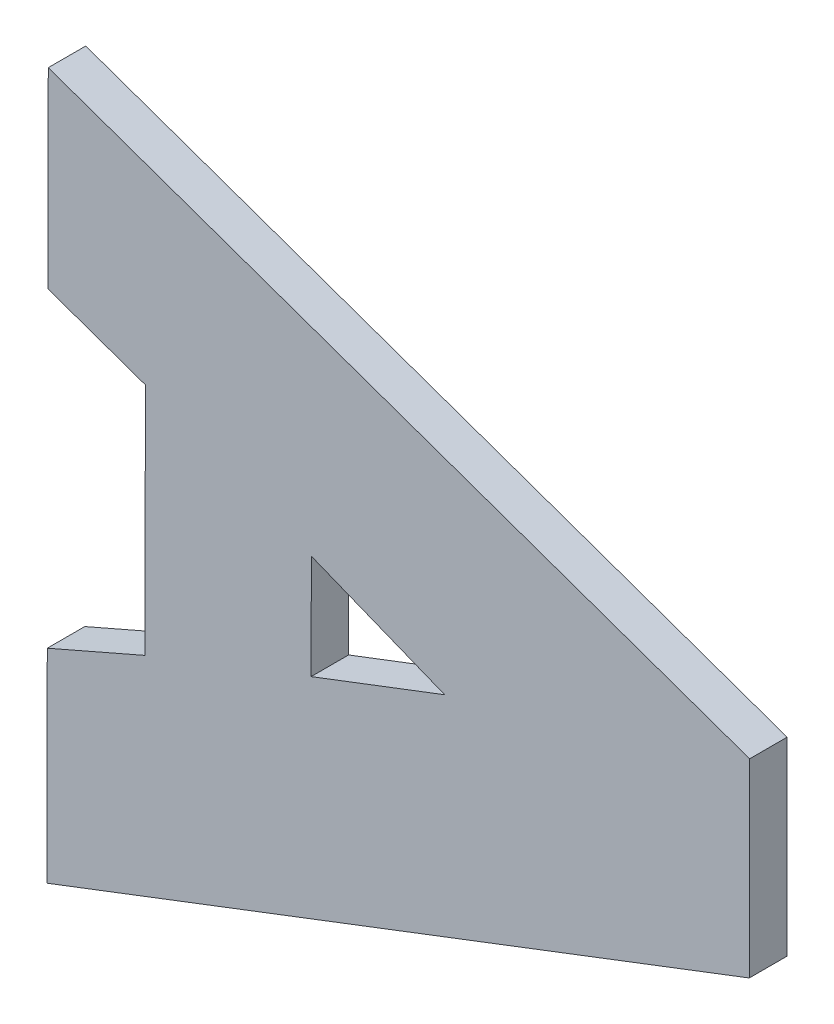
ISO-10303-21;
HEADER;
FILE_DESCRIPTION(('STEP AP214'),'2;1');
FILE_NAME('part.step','',(''),(''),'','','');
FILE_SCHEMA(('AUTOMOTIVE_DESIGN { 1 0 10303 214 1 1 1 1 }'));
ENDSEC;
DATA;
#1=APPLICATION_CONTEXT('core data for automotive mechanical design processes');
#2=APPLICATION_PROTOCOL_DEFINITION('international standard','automotive_design',2000,#1);
#3=PRODUCT_CONTEXT('',#1,'mechanical');
#4=PRODUCT('Part','Part','',(#3));
#5=PRODUCT_RELATED_PRODUCT_CATEGORY('part','',(#4));
#6=PRODUCT_DEFINITION_FORMATION('','',#4);
#7=PRODUCT_DEFINITION_CONTEXT('part definition',#1,'design');
#8=PRODUCT_DEFINITION('design','',#6,#7);
#9=PRODUCT_DEFINITION_SHAPE('','',#8);
#10=(LENGTH_UNIT() NAMED_UNIT(*) SI_UNIT(.MILLI.,.METRE.));
#11=(NAMED_UNIT(*) PLANE_ANGLE_UNIT() SI_UNIT($,.RADIAN.));
#12=(NAMED_UNIT(*) SI_UNIT($,.STERADIAN.) SOLID_ANGLE_UNIT());
#13=UNCERTAINTY_MEASURE_WITH_UNIT(LENGTH_MEASURE(1.E-05),#10,'distance_accuracy_value','');
#14=(GEOMETRIC_REPRESENTATION_CONTEXT(3) GLOBAL_UNCERTAINTY_ASSIGNED_CONTEXT((#13)) GLOBAL_UNIT_ASSIGNED_CONTEXT((#10,
#11,#12)) REPRESENTATION_CONTEXT('',''));
#15=CARTESIAN_POINT('',(0.,0.,0.));
#16=DIRECTION('',(0.,0.,1.));
#17=DIRECTION('',(1.,0.,0.));
#18=AXIS2_PLACEMENT_3D('',#15,#16,#17);
#19=CARTESIAN_POINT('',(-0.211971917546179,0.103309735996874,-0.37));
#20=DIRECTION('',(-0.357128348904956,0.93405532085012,0.));
#21=DIRECTION('',(0.93405532085012,0.357128348904956,0.));
#22=AXIS2_PLACEMENT_3D('',#19,#20,#21);
#23=PLANE('',#22);
#24=DIRECTION('',(0.93405532085012,0.357128348904956,0.));
#25=VECTOR('',#24,1.);
#26=CARTESIAN_POINT('',(-0.211971917546179,0.103309735996874,-0.37));
#27=LINE('',#26,#25);
#28=CARTESIAN_POINT('',(-0.211971917546179,0.103309735996874,-0.37));
#29=VERTEX_POINT('',#28);
#30=CARTESIAN_POINT('',(-0.201280430762891,0.107397537797285,-0.37));
#31=VERTEX_POINT('',#30);
#32=EDGE_CURVE('E11',#29,#31,#27,.T.);
#33=ORIENTED_EDGE('',*,*,#32,.T.);
#34=DIRECTION('',(0.,0.,-1.));
#35=VECTOR('',#34,1.);
#36=CARTESIAN_POINT('',(-0.201280430762891,0.107397537797285,-0.37));
#37=LINE('',#36,#35);
#38=CARTESIAN_POINT('',(-0.201280430762891,0.107397537797285,-0.373));
#39=VERTEX_POINT('',#38);
#40=EDGE_CURVE('E24',#31,#39,#37,.T.);
#41=ORIENTED_EDGE('',*,*,#40,.T.);
#42=DIRECTION('',(0.93405532085012,0.357128348904956,0.));
#43=VECTOR('',#42,1.);
#44=CARTESIAN_POINT('',(-0.211971917546179,0.103309735996874,-0.373));
#45=LINE('',#44,#43);
#46=CARTESIAN_POINT('',(-0.211971917546179,0.103309735996874,-0.373));
#47=VERTEX_POINT('',#46);
#48=EDGE_CURVE('E193',#47,#39,#45,.T.);
#49=ORIENTED_EDGE('',*,*,#48,.F.);
#50=DIRECTION('',(0.,0.,-1.));
#51=VECTOR('',#50,1.);
#52=CARTESIAN_POINT('',(-0.211971917546179,0.103309735996874,-0.37));
#53=LINE('',#52,#51);
#54=EDGE_CURVE('E190',#29,#47,#53,.T.);
#55=ORIENTED_EDGE('',*,*,#54,.F.);
#56=EDGE_LOOP('',(#33,#41,#49,#55));
#57=FACE_BOUND('',#56,.T.);
#58=ADVANCED_FACE('F17',(#57),#23,.T.);
#59=CARTESIAN_POINT('',(-0.211955416081027,0.111665249609776,-0.37));
#60=DIRECTION('',(0.999998049852571,-0.0019749154552604,0.));
#61=DIRECTION('',(-0.0019749154552604,-0.999998049852571,0.));
#62=AXIS2_PLACEMENT_3D('',#59,#60,#61);
#63=PLANE('',#62);
#64=DIRECTION('',(-0.0019749154552604,-0.999998049852571,0.));
#65=VECTOR('',#64,1.);
#66=CARTESIAN_POINT('',(-0.211955416081027,0.111665249609776,-0.37));
#67=LINE('',#66,#65);
#68=CARTESIAN_POINT('',(-0.211955416081027,0.111665249609776,-0.37));
#69=VERTEX_POINT('',#68);
#70=EDGE_CURVE('E187',#69,#29,#67,.T.);
#71=ORIENTED_EDGE('',*,*,#70,.T.);
#72=ORIENTED_EDGE('',*,*,#54,.T.);
#73=DIRECTION('',(-0.0019749154552604,-0.999998049852571,0.));
#74=VECTOR('',#73,1.);
#75=CARTESIAN_POINT('',(-0.211955416081027,0.111665249609776,-0.373));
#76=LINE('',#75,#74);
#77=CARTESIAN_POINT('',(-0.211955416081027,0.111665249609776,-0.373));
#78=VERTEX_POINT('',#77);
#79=EDGE_CURVE('E184',#78,#47,#76,.T.);
#80=ORIENTED_EDGE('',*,*,#79,.F.);
#81=DIRECTION('',(0.,0.,-1.));
#82=VECTOR('',#81,1.);
#83=CARTESIAN_POINT('',(-0.211955416081027,0.111665249609776,-0.37));
#84=LINE('',#83,#82);
#85=EDGE_CURVE('E181',#69,#78,#84,.T.);
#86=ORIENTED_EDGE('',*,*,#85,.F.);
#87=EDGE_LOOP('',(#71,#72,#80,#86));
#88=FACE_BOUND('',#87,.T.);
#89=ADVANCED_FACE('F200',(#88),#63,.T.);
#90=CARTESIAN_POINT('',(-0.201280430762891,0.107397537797285,-0.37));
#91=DIRECTION('',(-0.371219529354009,-0.928545131388985,0.));
#92=DIRECTION('',(-0.928545131388985,0.371219529354009,0.));
#93=AXIS2_PLACEMENT_3D('',#90,#91,#92);
#94=PLANE('',#93);
#95=DIRECTION('',(-0.928545131388985,0.371219529354009,0.));
#96=VECTOR('',#95,1.);
#97=CARTESIAN_POINT('',(-0.201280430762891,0.107397537797285,-0.37));
#98=LINE('',#97,#96);
#99=EDGE_CURVE('E178',#31,#69,#98,.T.);
#100=ORIENTED_EDGE('',*,*,#99,.T.);
#101=ORIENTED_EDGE('',*,*,#85,.T.);
#102=DIRECTION('',(-0.928545131388985,0.371219529354009,0.));
#103=VECTOR('',#102,1.);
#104=CARTESIAN_POINT('',(-0.201280430762891,0.107397537797285,-0.373));
#105=LINE('',#104,#103);
#106=EDGE_CURVE('E175',#39,#78,#105,.T.);
#107=ORIENTED_EDGE('',*,*,#106,.F.);
#108=ORIENTED_EDGE('',*,*,#40,.F.);
#109=EDGE_LOOP('',(#100,#101,#107,#108));
#110=FACE_BOUND('',#109,.T.);
#111=ADVANCED_FACE('F197',(#110),#94,.T.);
#112=CARTESIAN_POINT('',(-0.225269429314305,0.0981305630989811,-0.37));
#113=DIRECTION('',(-0.999998049852571,0.0019749154552456,0.));
#114=DIRECTION('',(0.0019749154552456,0.999998049852571,0.));
#115=AXIS2_PLACEMENT_3D('',#112,#113,#114);
#116=PLANE('',#115);
#117=DIRECTION('',(0.0019749154552456,0.999998049852571,0.));
#118=VECTOR('',#117,1.);
#119=CARTESIAN_POINT('',(-0.225269429314305,0.0981305630989811,-0.37));
#120=LINE('',#119,#118);
#121=CARTESIAN_POINT('',(-0.225269429314305,0.0981305630989811,-0.37));
#122=VERTEX_POINT('',#121);
#123=CARTESIAN_POINT('',(-0.225232368441466,0.11689632872515,-0.37));
#124=VERTEX_POINT('',#123);
#125=EDGE_CURVE('E173',#122,#124,#120,.T.);
#126=ORIENTED_EDGE('',*,*,#125,.T.);
#127=DIRECTION('',(0.,0.,-1.));
#128=VECTOR('',#127,1.);
#129=CARTESIAN_POINT('',(-0.225232368441466,0.11689632872515,-0.37));
#130=LINE('',#129,#128);
#131=CARTESIAN_POINT('',(-0.225232368441466,0.11689632872515,-0.373));
#132=VERTEX_POINT('',#131);
#133=EDGE_CURVE('E171',#124,#132,#130,.T.);
#134=ORIENTED_EDGE('',*,*,#133,.T.);
#135=DIRECTION('',(0.0019749154552456,0.999998049852571,0.));
#136=VECTOR('',#135,1.);
#137=CARTESIAN_POINT('',(-0.225269429314305,0.0981305630989811,-0.373));
#138=LINE('',#137,#136);
#139=CARTESIAN_POINT('',(-0.225269429314305,0.0981305630989811,-0.373));
#140=VERTEX_POINT('',#139);
#141=EDGE_CURVE('E121',#140,#132,#138,.T.);
#142=ORIENTED_EDGE('',*,*,#141,.F.);
#143=DIRECTION('',(0.,0.,-1.));
#144=VECTOR('',#143,1.);
#145=CARTESIAN_POINT('',(-0.225269429314305,0.0981305630989811,-0.37));
#146=LINE('',#145,#144);
#147=EDGE_CURVE('E167',#122,#140,#146,.T.);
#148=ORIENTED_EDGE('',*,*,#147,.F.);
#149=EDGE_LOOP('',(#126,#134,#142,#148));
#150=FACE_BOUND('',#149,.T.);
#151=ADVANCED_FACE('F217',(#150),#116,.T.);
#152=CARTESIAN_POINT('',(-0.233083735993868,0.0947221866397614,-0.37));
#153=DIRECTION('',(-0.399796369480729,0.916603983708356,0.));
#154=DIRECTION('',(0.916603983708356,0.399796369480729,0.));
#155=AXIS2_PLACEMENT_3D('',#152,#153,#154);
#156=PLANE('',#155);
#157=DIRECTION('',(0.916603983708356,0.399796369480729,0.));
#158=VECTOR('',#157,1.);
#159=CARTESIAN_POINT('',(-0.233083735993868,0.0947221866397614,-0.37));
#160=LINE('',#159,#158);
#161=CARTESIAN_POINT('',(-0.233083735993868,0.0947221866397614,-0.37));
#162=VERTEX_POINT('',#161);
#163=EDGE_CURVE('E164',#162,#122,#160,.T.);
#164=ORIENTED_EDGE('',*,*,#163,.T.);
#165=ORIENTED_EDGE('',*,*,#147,.T.);
#166=DIRECTION('',(0.916603983708356,0.399796369480729,0.));
#167=VECTOR('',#166,1.);
#168=CARTESIAN_POINT('',(-0.233083735993868,0.0947221866397614,-0.373));
#169=LINE('',#168,#167);
#170=CARTESIAN_POINT('',(-0.233083735993868,0.0947221866397614,-0.373));
#171=VERTEX_POINT('',#170);
#172=EDGE_CURVE('E162',#171,#140,#169,.T.);
#173=ORIENTED_EDGE('',*,*,#172,.F.);
#174=DIRECTION('',(0.,0.,-1.));
#175=VECTOR('',#174,1.);
#176=CARTESIAN_POINT('',(-0.233083735993868,0.0947221866397614,-0.37));
#177=LINE('',#176,#175);
#178=EDGE_CURVE('E159',#162,#171,#177,.T.);
#179=ORIENTED_EDGE('',*,*,#178,.F.);
#180=EDGE_LOOP('',(#164,#165,#173,#179));
#181=FACE_BOUND('',#180,.T.);
#182=ADVANCED_FACE('F222',(#181),#156,.T.);
#183=CARTESIAN_POINT('',(-0.2331159264253,0.0784225680561487,-0.37));
#184=DIRECTION('',(-0.999998049852571,0.0019749154552604,0.));
#185=DIRECTION('',(0.0019749154552604,0.999998049852571,0.));
#186=AXIS2_PLACEMENT_3D('',#183,#184,#185);
#187=PLANE('',#186);
#188=DIRECTION('',(0.0019749154552604,0.999998049852571,0.));
#189=VECTOR('',#188,1.);
#190=CARTESIAN_POINT('',(-0.2331159264253,0.0784225680561487,-0.37));
#191=LINE('',#190,#189);
#192=CARTESIAN_POINT('',(-0.2331159264253,0.0784225680561487,-0.37));
#193=VERTEX_POINT('',#192);
#194=EDGE_CURVE('E156',#193,#162,#191,.T.);
#195=ORIENTED_EDGE('',*,*,#194,.T.);
#196=ORIENTED_EDGE('',*,*,#178,.T.);
#197=DIRECTION('',(0.0019749154552604,0.999998049852571,0.));
#198=VECTOR('',#197,1.);
#199=CARTESIAN_POINT('',(-0.2331159264253,0.0784225680561487,-0.373));
#200=LINE('',#199,#198);
#201=CARTESIAN_POINT('',(-0.2331159264253,0.0784225680561487,-0.373));
#202=VERTEX_POINT('',#201);
#203=EDGE_CURVE('E153',#202,#171,#200,.T.);
#204=ORIENTED_EDGE('',*,*,#203,.F.);
#205=DIRECTION('',(0.,0.,-1.));
#206=VECTOR('',#205,1.);
#207=CARTESIAN_POINT('',(-0.2331159264253,0.0784225680561487,-0.37));
#208=LINE('',#207,#206);
#209=EDGE_CURVE('E150',#193,#202,#208,.T.);
#210=ORIENTED_EDGE('',*,*,#209,.F.);
#211=EDGE_LOOP('',(#195,#196,#204,#210));
#212=FACE_BOUND('',#211,.T.);
#213=ADVANCED_FACE('F226',(#212),#187,.T.);
#214=CARTESIAN_POINT('',(-0.176914177766853,0.0999532512495337,-0.37));
#215=DIRECTION('',(0.357743033816988,-0.933820069261428,0.));
#216=DIRECTION('',(-0.933820069261428,-0.357743033816988,0.));
#217=AXIS2_PLACEMENT_3D('',#214,#215,#216);
#218=PLANE('',#217);
#219=DIRECTION('',(-0.933820069261428,-0.357743033816988,0.));
#220=VECTOR('',#219,1.);
#221=CARTESIAN_POINT('',(-0.176914177766853,0.0999532512495337,-0.37));
#222=LINE('',#221,#220);
#223=CARTESIAN_POINT('',(-0.176914177766853,0.0999532512495337,-0.37));
#224=VERTEX_POINT('',#223);
#225=EDGE_CURVE('E147',#224,#193,#222,.T.);
#226=ORIENTED_EDGE('',*,*,#225,.T.);
#227=ORIENTED_EDGE('',*,*,#209,.T.);
#228=DIRECTION('',(-0.933820069261428,-0.357743033816988,0.));
#229=VECTOR('',#228,1.);
#230=CARTESIAN_POINT('',(-0.176914177766853,0.0999532512495337,-0.373));
#231=LINE('',#230,#229);
#232=CARTESIAN_POINT('',(-0.176914177766853,0.0999532512495337,-0.373));
#233=VERTEX_POINT('',#232);
#234=EDGE_CURVE('E144',#233,#202,#231,.T.);
#235=ORIENTED_EDGE('',*,*,#234,.F.);
#236=DIRECTION('',(0.,0.,-1.));
#237=VECTOR('',#236,1.);
#238=CARTESIAN_POINT('',(-0.176914177766853,0.0999532512495337,-0.37));
#239=LINE('',#238,#237);
#240=EDGE_CURVE('E141',#224,#233,#239,.T.);
#241=ORIENTED_EDGE('',*,*,#240,.F.);
#242=EDGE_LOOP('',(#226,#227,#235,#241));
#243=FACE_BOUND('',#242,.T.);
#244=ADVANCED_FACE('F230',(#243),#218,.T.);
#245=CARTESIAN_POINT('',(-0.176884150585215,0.115157508728516,-0.37));
#246=DIRECTION('',(0.999998049852571,-0.0019749154552512,0.));
#247=DIRECTION('',(-0.0019749154552512,-0.999998049852571,0.));
#248=AXIS2_PLACEMENT_3D('',#245,#246,#247);
#249=PLANE('',#248);
#250=DIRECTION('',(-0.0019749154552512,-0.999998049852571,0.));
#251=VECTOR('',#250,1.);
#252=CARTESIAN_POINT('',(-0.176884150585215,0.115157508728516,-0.37));
#253=LINE('',#252,#251);
#254=CARTESIAN_POINT('',(-0.176884150585215,0.115157508728516,-0.37));
#255=VERTEX_POINT('',#254);
#256=EDGE_CURVE('E138',#255,#224,#253,.T.);
#257=ORIENTED_EDGE('',*,*,#256,.T.);
#258=ORIENTED_EDGE('',*,*,#240,.T.);
#259=DIRECTION('',(-0.0019749154552512,-0.999998049852571,0.));
#260=VECTOR('',#259,1.);
#261=CARTESIAN_POINT('',(-0.176884150585215,0.115157508728516,-0.373));
#262=LINE('',#261,#260);
#263=CARTESIAN_POINT('',(-0.176884150585215,0.115157508728516,-0.373));
#264=VERTEX_POINT('',#263);
#265=EDGE_CURVE('E135',#264,#233,#262,.T.);
#266=ORIENTED_EDGE('',*,*,#265,.F.);
#267=DIRECTION('',(0.,0.,-1.));
#268=VECTOR('',#267,1.);
#269=CARTESIAN_POINT('',(-0.176884150585215,0.115157508728516,-0.37));
#270=LINE('',#269,#268);
#271=EDGE_CURVE('E132',#255,#264,#270,.T.);
#272=ORIENTED_EDGE('',*,*,#271,.F.);
#273=EDGE_LOOP('',(#257,#258,#266,#272));
#274=FACE_BOUND('',#273,.T.);
#275=ADVANCED_FACE('F234',(#274),#249,.T.);
#276=CARTESIAN_POINT('',(-0.233004207830638,0.134991256349735,-0.37));
#277=DIRECTION('',(0.333218506002908,0.942849631307766,0.));
#278=DIRECTION('',(0.942849631307766,-0.333218506002908,0.));
#279=AXIS2_PLACEMENT_3D('',#276,#277,#278);
#280=PLANE('',#279);
#281=DIRECTION('',(0.942849631307766,-0.333218506002908,0.));
#282=VECTOR('',#281,1.);
#283=CARTESIAN_POINT('',(-0.233004207830638,0.134991256349735,-0.37));
#284=LINE('',#283,#282);
#285=CARTESIAN_POINT('',(-0.233004207830638,0.134991256349735,-0.37));
#286=VERTEX_POINT('',#285);
#287=EDGE_CURVE('E129',#286,#255,#284,.T.);
#288=ORIENTED_EDGE('',*,*,#287,.T.);
#289=ORIENTED_EDGE('',*,*,#271,.T.);
#290=DIRECTION('',(0.942849631307766,-0.333218506002908,0.));
#291=VECTOR('',#290,1.);
#292=CARTESIAN_POINT('',(-0.233004207830638,0.134991256349735,-0.373));
#293=LINE('',#292,#291);
#294=CARTESIAN_POINT('',(-0.233004207830638,0.134991256349735,-0.373));
#295=VERTEX_POINT('',#294);
#296=EDGE_CURVE('E127',#295,#264,#293,.T.);
#297=ORIENTED_EDGE('',*,*,#296,.F.);
#298=DIRECTION('',(0.,0.,-1.));
#299=VECTOR('',#298,1.);
#300=CARTESIAN_POINT('',(-0.233004207830638,0.134991256349735,-0.37));
#301=LINE('',#300,#299);
#302=EDGE_CURVE('E103',#286,#295,#301,.T.);
#303=ORIENTED_EDGE('',*,*,#302,.F.);
#304=EDGE_LOOP('',(#288,#289,#297,#303));
#305=FACE_BOUND('',#304,.T.);
#306=ADVANCED_FACE('F238',(#305),#280,.T.);
#307=CARTESIAN_POINT('',(-0.233034503569326,0.119651015061859,-0.37));
#308=DIRECTION('',(-0.999998049852571,0.0019749154552604,0.));
#309=DIRECTION('',(0.0019749154552604,0.999998049852571,0.));
#310=AXIS2_PLACEMENT_3D('',#307,#308,#309);
#311=PLANE('',#310);
#312=DIRECTION('',(0.0019749154552604,0.999998049852571,0.));
#313=VECTOR('',#312,1.);
#314=CARTESIAN_POINT('',(-0.233034503569326,0.119651015061859,-0.37));
#315=LINE('',#314,#313);
#316=CARTESIAN_POINT('',(-0.233034503569326,0.119651015061859,-0.37));
#317=VERTEX_POINT('',#316);
#318=EDGE_CURVE('E107',#317,#286,#315,.T.);
#319=ORIENTED_EDGE('',*,*,#318,.T.);
#320=ORIENTED_EDGE('',*,*,#302,.T.);
#321=DIRECTION('',(0.0019749154552604,0.999998049852571,0.));
#322=VECTOR('',#321,1.);
#323=CARTESIAN_POINT('',(-0.233034503569326,0.119651015061859,-0.373));
#324=LINE('',#323,#322);
#325=CARTESIAN_POINT('',(-0.233034503569326,0.119651015061859,-0.373));
#326=VERTEX_POINT('',#325);
#327=EDGE_CURVE('E96',#326,#295,#324,.T.);
#328=ORIENTED_EDGE('',*,*,#327,.F.);
#329=DIRECTION('',(0.,0.,-1.));
#330=VECTOR('',#329,1.);
#331=CARTESIAN_POINT('',(-0.233034503569326,0.119651015061859,-0.37));
#332=LINE('',#331,#330);
#333=EDGE_CURVE('E100',#317,#326,#332,.T.);
#334=ORIENTED_EDGE('',*,*,#333,.F.);
#335=EDGE_LOOP('',(#319,#320,#328,#334));
#336=FACE_BOUND('',#335,.T.);
#337=ADVANCED_FACE('F99',(#336),#311,.T.);
#338=CARTESIAN_POINT('',(-0.225232368441466,0.11689632872515,-0.37));
#339=DIRECTION('',(-0.33292668222817,-0.942952715813759,0.));
#340=DIRECTION('',(-0.942952715813759,0.33292668222817,0.));
#341=AXIS2_PLACEMENT_3D('',#338,#339,#340);
#342=PLANE('',#341);
#343=DIRECTION('',(-0.942952715813759,0.33292668222817,0.));
#344=VECTOR('',#343,1.);
#345=CARTESIAN_POINT('',(-0.225232368441466,0.11689632872515,-0.37));
#346=LINE('',#345,#344);
#347=EDGE_CURVE('E115',#124,#317,#346,.T.);
#348=ORIENTED_EDGE('',*,*,#347,.T.);
#349=ORIENTED_EDGE('',*,*,#333,.T.);
#350=DIRECTION('',(-0.942952715813759,0.33292668222817,0.));
#351=VECTOR('',#350,1.);
#352=CARTESIAN_POINT('',(-0.225232368441466,0.11689632872515,-0.373));
#353=LINE('',#352,#351);
#354=EDGE_CURVE('E113',#132,#326,#353,.T.);
#355=ORIENTED_EDGE('',*,*,#354,.F.);
#356=ORIENTED_EDGE('',*,*,#133,.F.);
#357=EDGE_LOOP('',(#348,#349,#355,#356));
#358=FACE_BOUND('',#357,.T.);
#359=ADVANCED_FACE('F111',(#358),#342,.T.);
#360=CARTESIAN_POINT('',(-0.205000038505257,0.106706912202942,-0.373));
#361=DIRECTION('',(0.,0.,-1.));
#362=DIRECTION('',(-1.,0.,0.));
#363=AXIS2_PLACEMENT_3D('',#360,#361,#362);
#364=PLANE('',#363);
#365=ORIENTED_EDGE('',*,*,#354,.T.);
#366=ORIENTED_EDGE('',*,*,#327,.T.);
#367=ORIENTED_EDGE('',*,*,#296,.T.);
#368=ORIENTED_EDGE('',*,*,#265,.T.);
#369=ORIENTED_EDGE('',*,*,#234,.T.);
#370=ORIENTED_EDGE('',*,*,#203,.T.);
#371=ORIENTED_EDGE('',*,*,#172,.T.);
#372=ORIENTED_EDGE('',*,*,#141,.T.);
#373=EDGE_LOOP('',(#365,#366,#367,#368,#369,#370,#371,#372));
#374=FACE_BOUND('',#373,.T.);
#375=ORIENTED_EDGE('',*,*,#106,.T.);
#376=ORIENTED_EDGE('',*,*,#79,.T.);
#377=ORIENTED_EDGE('',*,*,#48,.T.);
#378=EDGE_LOOP('',(#375,#376,#377));
#379=FACE_BOUND('',#378,.T.);
#380=ADVANCED_FACE('F118',(#374,#379),#364,.T.);
#381=CARTESIAN_POINT('',(-0.205000038505257,0.106706912202942,-0.37));
#382=DIRECTION('',(0.,0.,-1.));
#383=DIRECTION('',(-1.,0.,0.));
#384=AXIS2_PLACEMENT_3D('',#381,#382,#383);
#385=PLANE('',#384);
#386=ORIENTED_EDGE('',*,*,#347,.F.);
#387=ORIENTED_EDGE('',*,*,#125,.F.);
#388=ORIENTED_EDGE('',*,*,#163,.F.);
#389=ORIENTED_EDGE('',*,*,#194,.F.);
#390=ORIENTED_EDGE('',*,*,#225,.F.);
#391=ORIENTED_EDGE('',*,*,#256,.F.);
#392=ORIENTED_EDGE('',*,*,#287,.F.);
#393=ORIENTED_EDGE('',*,*,#318,.F.);
#394=EDGE_LOOP('',(#386,#387,#388,#389,#390,#391,#392,#393));
#395=FACE_BOUND('',#394,.T.);
#396=ORIENTED_EDGE('',*,*,#99,.F.);
#397=ORIENTED_EDGE('',*,*,#32,.F.);
#398=ORIENTED_EDGE('',*,*,#70,.F.);
#399=EDGE_LOOP('',(#396,#397,#398));
#400=FACE_BOUND('',#399,.T.);
#401=ADVANCED_FACE('F201',(#395,#400),#385,.F.);
#402=CLOSED_SHELL('',(#58,#89,#111,#151,#182,#213,#244,#275,#306,#337,#359,#380,#401));
#403=MANIFOLD_SOLID_BREP('B1',#402);
#404=ADVANCED_BREP_SHAPE_REPRESENTATION('',(#18,#403),#14);
#405=SHAPE_DEFINITION_REPRESENTATION(#9,#404);
ENDSEC;
END-ISO-10303-21;
